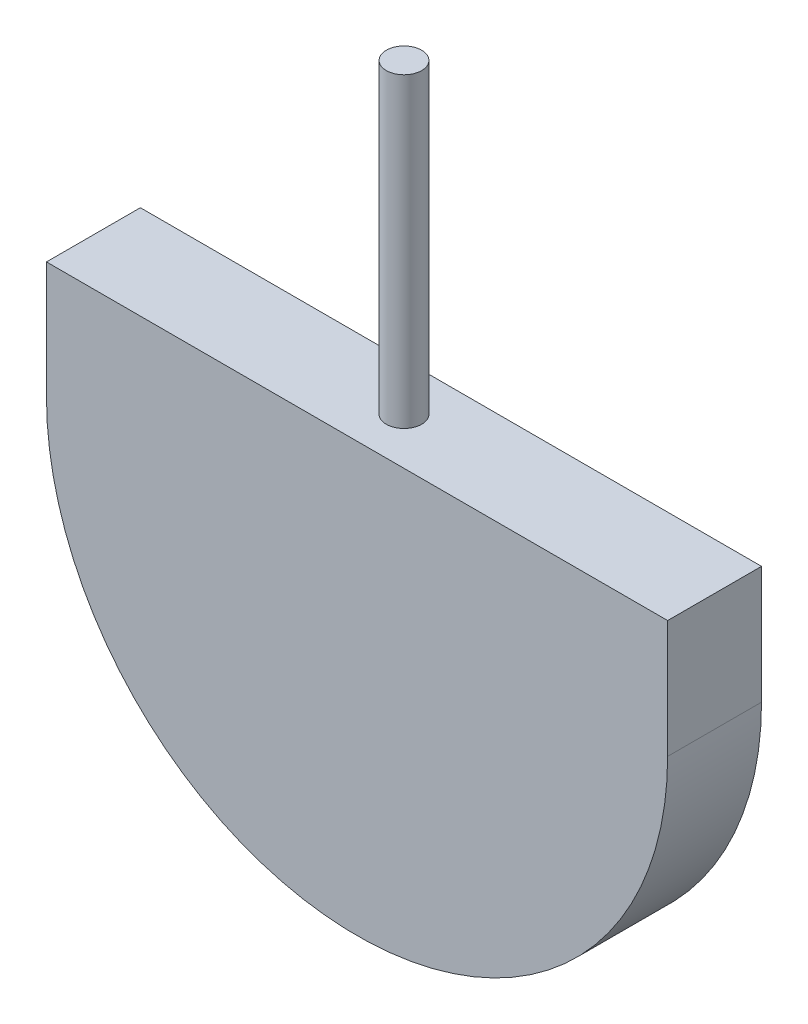
ISO-10303-21;
HEADER;
FILE_DESCRIPTION(('STEP AP214'),'2;1');
FILE_NAME('part.step','',(''),(''),'','','');
FILE_SCHEMA(('AUTOMOTIVE_DESIGN { 1 0 10303 214 1 1 1 1 }'));
ENDSEC;
DATA;
#1=APPLICATION_CONTEXT('core data for automotive mechanical design processes');
#2=APPLICATION_PROTOCOL_DEFINITION('international standard','automotive_design',2000,#1);
#3=PRODUCT_CONTEXT('',#1,'mechanical');
#4=PRODUCT('Part','Part','',(#3));
#5=PRODUCT_RELATED_PRODUCT_CATEGORY('part','',(#4));
#6=PRODUCT_DEFINITION_FORMATION('','',#4);
#7=PRODUCT_DEFINITION_CONTEXT('part definition',#1,'design');
#8=PRODUCT_DEFINITION('design','',#6,#7);
#9=PRODUCT_DEFINITION_SHAPE('','',#8);
#10=(LENGTH_UNIT() NAMED_UNIT(*) SI_UNIT(.MILLI.,.METRE.));
#11=(NAMED_UNIT(*) PLANE_ANGLE_UNIT() SI_UNIT($,.RADIAN.));
#12=(NAMED_UNIT(*) SI_UNIT($,.STERADIAN.) SOLID_ANGLE_UNIT());
#13=UNCERTAINTY_MEASURE_WITH_UNIT(LENGTH_MEASURE(1.E-05),#10,'distance_accuracy_value','');
#14=(GEOMETRIC_REPRESENTATION_CONTEXT(3) GLOBAL_UNCERTAINTY_ASSIGNED_CONTEXT((#13)) GLOBAL_UNIT_ASSIGNED_CONTEXT((#10,
#11,#12)) REPRESENTATION_CONTEXT('',''));
#15=CARTESIAN_POINT('',(0.,0.,0.));
#16=DIRECTION('',(0.,0.,1.));
#17=DIRECTION('',(1.,0.,0.));
#18=AXIS2_PLACEMENT_3D('',#15,#16,#17);
#19=CARTESIAN_POINT('',(-13.2,2.5,3.99));
#20=DIRECTION('',(0.,-1.,0.));
#21=DIRECTION('',(0.,0.,-1.));
#22=AXIS2_PLACEMENT_3D('',#19,#20,#21);
#23=PLANE('',#22);
#24=DIRECTION('',(-1.,0.,0.));
#25=VECTOR('',#24,1.);
#26=CARTESIAN_POINT('',(-13.2,2.5,0.));
#27=LINE('',#26,#25);
#28=CARTESIAN_POINT('',(13.2,2.5,0.));
#29=VERTEX_POINT('',#28);
#30=CARTESIAN_POINT('',(-13.2,2.5,0.));
#31=VERTEX_POINT('',#30);
#32=EDGE_CURVE('E91',#29,#31,#27,.T.);
#33=ORIENTED_EDGE('',*,*,#32,.T.);
#34=DIRECTION('',(0.,0.,-1.));
#35=VECTOR('',#34,1.);
#36=CARTESIAN_POINT('',(-13.2,2.5,3.99));
#37=LINE('',#36,#35);
#38=CARTESIAN_POINT('',(-13.2,2.5,3.99));
#39=VERTEX_POINT('',#38);
#40=EDGE_CURVE('E89',#39,#31,#37,.T.);
#41=ORIENTED_EDGE('',*,*,#40,.F.);
#42=DIRECTION('',(-1.,0.,0.));
#43=VECTOR('',#42,1.);
#44=CARTESIAN_POINT('',(-13.2,2.5,3.99));
#45=LINE('',#44,#43);
#46=CARTESIAN_POINT('',(13.2,2.5,3.99));
#47=VERTEX_POINT('',#46);
#48=EDGE_CURVE('E81',#47,#39,#45,.T.);
#49=ORIENTED_EDGE('',*,*,#48,.F.);
#50=DIRECTION('',(0.,0.,-1.));
#51=VECTOR('',#50,1.);
#52=CARTESIAN_POINT('',(13.2,2.5,3.99));
#53=LINE('',#52,#51);
#54=EDGE_CURVE('E42',#47,#29,#53,.T.);
#55=ORIENTED_EDGE('',*,*,#54,.T.);
#56=EDGE_LOOP('',(#33,#41,#49,#55));
#57=FACE_BOUND('',#56,.T.);
#58=CARTESIAN_POINT('',(0.,2.5,1.995));
#59=DIRECTION('',(0.,-1.,0.));
#60=DIRECTION('',(0.,0.,-1.));
#61=AXIS2_PLACEMENT_3D('',#58,#59,#60);
#62=CIRCLE('',#61,0.75);
#63=CARTESIAN_POINT('',(0.,2.5,1.245));
#64=VERTEX_POINT('',#63);
#65=EDGE_CURVE('E11',#64,#64,#62,.F.);
#66=ORIENTED_EDGE('',*,*,#65,.F.);
#67=EDGE_LOOP('',(#66));
#68=FACE_BOUND('',#67,.T.);
#69=ADVANCED_FACE('F33',(#57,#68),#23,.F.);
#70=CARTESIAN_POINT('',(13.2,-2.5,3.99));
#71=DIRECTION('',(-1.,0.,0.));
#72=DIRECTION('',(0.,-1.,0.));
#73=AXIS2_PLACEMENT_3D('',#70,#71,#72);
#74=PLANE('',#73);
#75=DIRECTION('',(0.,1.,0.));
#76=VECTOR('',#75,1.);
#77=CARTESIAN_POINT('',(13.2,-2.5,0.));
#78=LINE('',#77,#76);
#79=CARTESIAN_POINT('',(13.2,-2.5,0.));
#80=VERTEX_POINT('',#79);
#81=EDGE_CURVE('E100',#80,#29,#78,.T.);
#82=ORIENTED_EDGE('',*,*,#81,.T.);
#83=ORIENTED_EDGE('',*,*,#54,.F.);
#84=DIRECTION('',(0.,1.,0.));
#85=VECTOR('',#84,1.);
#86=CARTESIAN_POINT('',(13.2,-2.5,3.99));
#87=LINE('',#86,#85);
#88=CARTESIAN_POINT('',(13.2,-2.5,3.99));
#89=VERTEX_POINT('',#88);
#90=EDGE_CURVE('E86',#89,#47,#87,.T.);
#91=ORIENTED_EDGE('',*,*,#90,.F.);
#92=DIRECTION('',(0.,0.,-1.));
#93=VECTOR('',#92,1.);
#94=CARTESIAN_POINT('',(13.2,-2.5,3.99));
#95=LINE('',#94,#93);
#96=EDGE_CURVE('E96',#89,#80,#95,.T.);
#97=ORIENTED_EDGE('',*,*,#96,.T.);
#98=EDGE_LOOP('',(#82,#83,#91,#97));
#99=FACE_BOUND('',#98,.T.);
#100=ADVANCED_FACE('F35',(#99),#74,.F.);
#101=CARTESIAN_POINT('',(-13.2,-2.5,3.99));
#102=DIRECTION('',(1.,0.,0.));
#103=DIRECTION('',(0.,0.,-1.));
#104=AXIS2_PLACEMENT_3D('',#101,#102,#103);
#105=PLANE('',#104);
#106=DIRECTION('',(0.,-1.,0.));
#107=VECTOR('',#106,1.);
#108=CARTESIAN_POINT('',(-13.2,-2.5,0.));
#109=LINE('',#108,#107);
#110=CARTESIAN_POINT('',(-13.2,-2.5,0.));
#111=VERTEX_POINT('',#110);
#112=EDGE_CURVE('E67',#31,#111,#109,.T.);
#113=ORIENTED_EDGE('',*,*,#112,.T.);
#114=DIRECTION('',(0.,0.,-1.));
#115=VECTOR('',#114,1.);
#116=CARTESIAN_POINT('',(-13.2,-2.5,3.99));
#117=LINE('',#116,#115);
#118=CARTESIAN_POINT('',(-13.2,-2.5,3.99));
#119=VERTEX_POINT('',#118);
#120=EDGE_CURVE('E92',#119,#111,#117,.T.);
#121=ORIENTED_EDGE('',*,*,#120,.F.);
#122=DIRECTION('',(0.,-1.,0.));
#123=VECTOR('',#122,1.);
#124=CARTESIAN_POINT('',(-13.2,-2.5,3.99));
#125=LINE('',#124,#123);
#126=EDGE_CURVE('E84',#39,#119,#125,.T.);
#127=ORIENTED_EDGE('',*,*,#126,.F.);
#128=ORIENTED_EDGE('',*,*,#40,.T.);
#129=EDGE_LOOP('',(#113,#121,#127,#128));
#130=FACE_BOUND('',#129,.T.);
#131=ADVANCED_FACE('F94',(#130),#105,.F.);
#132=CARTESIAN_POINT('',(0.,-2.5,3.99));
#133=DIRECTION('',(0.,0.,-1.));
#134=DIRECTION('',(-1.,0.,0.));
#135=AXIS2_PLACEMENT_3D('',#132,#133,#134);
#136=CYLINDRICAL_SURFACE('',#135,13.2);
#137=CARTESIAN_POINT('',(0.,-2.5,0.));
#138=DIRECTION('',(0.,0.,1.));
#139=DIRECTION('',(1.,0.,0.));
#140=AXIS2_PLACEMENT_3D('',#137,#138,#139);
#141=CIRCLE('',#140,13.2);
#142=EDGE_CURVE('E73',#111,#80,#141,.T.);
#143=ORIENTED_EDGE('',*,*,#142,.T.);
#144=ORIENTED_EDGE('',*,*,#96,.F.);
#145=CARTESIAN_POINT('',(0.,-2.5,3.99));
#146=DIRECTION('',(0.,0.,1.));
#147=DIRECTION('',(1.,0.,0.));
#148=AXIS2_PLACEMENT_3D('',#145,#146,#147);
#149=CIRCLE('',#148,13.2);
#150=EDGE_CURVE('E50',#119,#89,#149,.T.);
#151=ORIENTED_EDGE('',*,*,#150,.F.);
#152=ORIENTED_EDGE('',*,*,#120,.T.);
#153=EDGE_LOOP('',(#143,#144,#151,#152));
#154=FACE_BOUND('',#153,.T.);
#155=ADVANCED_FACE('F122',(#154),#136,.T.);
#156=CARTESIAN_POINT('',(0.,-2.5,3.99));
#157=DIRECTION('',(0.,0.,1.));
#158=DIRECTION('',(1.,0.,0.));
#159=AXIS2_PLACEMENT_3D('',#156,#157,#158);
#160=PLANE('',#159);
#161=ORIENTED_EDGE('',*,*,#90,.T.);
#162=ORIENTED_EDGE('',*,*,#48,.T.);
#163=ORIENTED_EDGE('',*,*,#126,.T.);
#164=ORIENTED_EDGE('',*,*,#150,.T.);
#165=EDGE_LOOP('',(#161,#162,#163,#164));
#166=FACE_BOUND('',#165,.T.);
#167=ADVANCED_FACE('F82',(#166),#160,.T.);
#168=CARTESIAN_POINT('',(0.,-2.5,0.));
#169=DIRECTION('',(0.,0.,1.));
#170=DIRECTION('',(1.,0.,0.));
#171=AXIS2_PLACEMENT_3D('',#168,#169,#170);
#172=PLANE('',#171);
#173=ORIENTED_EDGE('',*,*,#81,.F.);
#174=ORIENTED_EDGE('',*,*,#142,.F.);
#175=ORIENTED_EDGE('',*,*,#112,.F.);
#176=ORIENTED_EDGE('',*,*,#32,.F.);
#177=EDGE_LOOP('',(#173,#174,#175,#176));
#178=FACE_BOUND('',#177,.T.);
#179=ADVANCED_FACE('F111',(#178),#172,.F.);
#180=CARTESIAN_POINT('',(0.,17.6412990169285,1.995));
#181=DIRECTION('',(0.,-1.,0.));
#182=DIRECTION('',(0.,0.,-1.));
#183=AXIS2_PLACEMENT_3D('',#180,#181,#182);
#184=CYLINDRICAL_SURFACE('',#183,0.75);
#185=ORIENTED_EDGE('',*,*,#65,.T.);
#186=EDGE_LOOP('',(#185));
#187=FACE_BOUND('',#186,.T.);
#188=CARTESIAN_POINT('',(0.,15.5199786733689,1.995));
#189=DIRECTION('',(0.,1.,0.));
#190=DIRECTION('',(-1.,0.,0.));
#191=AXIS2_PLACEMENT_3D('',#188,#189,#190);
#192=CIRCLE('',#191,0.75);
#193=CARTESIAN_POINT('',(-0.749999999999997,15.5199786733689,1.995));
#194=VERTEX_POINT('',#193);
#195=EDGE_CURVE('E103',#194,#194,#192,.T.);
#196=ORIENTED_EDGE('',*,*,#195,.F.);
#197=EDGE_LOOP('',(#196));
#198=FACE_BOUND('',#197,.T.);
#199=ADVANCED_FACE('F113',(#187,#198),#184,.T.);
#200=CARTESIAN_POINT('',(0.,15.5199786733689,1.995));
#201=DIRECTION('',(0.,1.,0.));
#202=DIRECTION('',(-1.,0.,0.));
#203=AXIS2_PLACEMENT_3D('',#200,#201,#202);
#204=PLANE('',#203);
#205=ORIENTED_EDGE('',*,*,#195,.T.);
#206=EDGE_LOOP('',(#205));
#207=FACE_BOUND('',#206,.T.);
#208=ADVANCED_FACE('F119',(#207),#204,.T.);
#209=CLOSED_SHELL('',(#69,#100,#131,#155,#167,#179,#199,#208));
#210=MANIFOLD_SOLID_BREP('B2',#209);
#211=ADVANCED_BREP_SHAPE_REPRESENTATION('',(#18,#210),#14);
#212=SHAPE_DEFINITION_REPRESENTATION(#9,#211);
ENDSEC;
END-ISO-10303-21;
